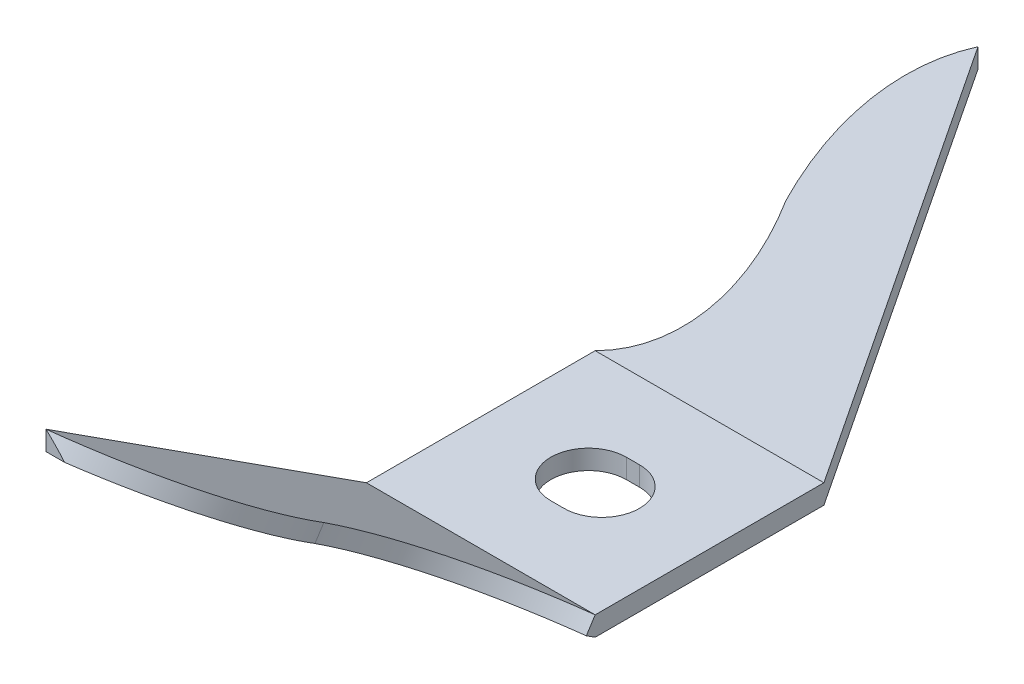
ISO-10303-21;
HEADER;
FILE_DESCRIPTION(('STEP AP214'),'2;1');
FILE_NAME('part.step','',(''),(''),'','','');
FILE_SCHEMA(('AUTOMOTIVE_DESIGN { 1 0 10303 214 1 1 1 1 }'));
ENDSEC;
DATA;
#1=APPLICATION_CONTEXT('core data for automotive mechanical design processes');
#2=APPLICATION_PROTOCOL_DEFINITION('international standard','automotive_design',2000,#1);
#3=PRODUCT_CONTEXT('',#1,'mechanical');
#4=PRODUCT('Part','Part','',(#3));
#5=PRODUCT_RELATED_PRODUCT_CATEGORY('part','',(#4));
#6=PRODUCT_DEFINITION_FORMATION('','',#4);
#7=PRODUCT_DEFINITION_CONTEXT('part definition',#1,'design');
#8=PRODUCT_DEFINITION('design','',#6,#7);
#9=PRODUCT_DEFINITION_SHAPE('','',#8);
#10=(LENGTH_UNIT() NAMED_UNIT(*) SI_UNIT(.MILLI.,.METRE.));
#11=(NAMED_UNIT(*) PLANE_ANGLE_UNIT() SI_UNIT($,.RADIAN.));
#12=(NAMED_UNIT(*) SI_UNIT($,.STERADIAN.) SOLID_ANGLE_UNIT());
#13=UNCERTAINTY_MEASURE_WITH_UNIT(LENGTH_MEASURE(1.E-05),#10,'distance_accuracy_value','');
#14=(GEOMETRIC_REPRESENTATION_CONTEXT(3) GLOBAL_UNCERTAINTY_ASSIGNED_CONTEXT((#13)) GLOBAL_UNIT_ASSIGNED_CONTEXT((#10,
#11,#12)) REPRESENTATION_CONTEXT('',''));
#15=CARTESIAN_POINT('',(0.,0.,0.));
#16=DIRECTION('',(0.,0.,1.));
#17=DIRECTION('',(1.,0.,0.));
#18=AXIS2_PLACEMENT_3D('',#15,#16,#17);
#19=CARTESIAN_POINT('',(0.,1.2954,0.));
#20=DIRECTION('',(0.,-1.,0.));
#21=DIRECTION('',(0.,0.,-1.));
#22=AXIS2_PLACEMENT_3D('',#19,#20,#21);
#23=PLANE('',#22);
#24=DIRECTION('',(0.,0.,-1.));
#25=VECTOR('',#24,1.);
#26=CARTESIAN_POINT('',(7.62,1.2954,7.62));
#27=LINE('',#26,#25);
#28=CARTESIAN_POINT('',(7.62,1.2954,7.62));
#29=VERTEX_POINT('',#28);
#30=CARTESIAN_POINT('',(7.62,1.2954,-7.62));
#31=VERTEX_POINT('',#30);
#32=EDGE_CURVE('E219',#29,#31,#27,.T.);
#33=ORIENTED_EDGE('',*,*,#32,.T.);
#34=DIRECTION('',(-1.,0.,0.));
#35=VECTOR('',#34,1.);
#36=CARTESIAN_POINT('',(-7.62,1.2954,-7.62));
#37=LINE('',#36,#35);
#38=CARTESIAN_POINT('',(-7.62,1.2954,-7.62));
#39=VERTEX_POINT('',#38);
#40=EDGE_CURVE('E165',#31,#39,#37,.T.);
#41=ORIENTED_EDGE('',*,*,#40,.T.);
#42=DIRECTION('',(0.,0.,1.));
#43=VECTOR('',#42,1.);
#44=CARTESIAN_POINT('',(-7.62,1.2954,7.62));
#45=LINE('',#44,#43);
#46=CARTESIAN_POINT('',(-7.62,1.2954,7.62));
#47=VERTEX_POINT('',#46);
#48=EDGE_CURVE('E223',#39,#47,#45,.T.);
#49=ORIENTED_EDGE('',*,*,#48,.T.);
#50=DIRECTION('',(1.,0.,0.));
#51=VECTOR('',#50,1.);
#52=CARTESIAN_POINT('',(-7.62,1.2954,7.62));
#53=LINE('',#52,#51);
#54=EDGE_CURVE('E225',#47,#29,#53,.T.);
#55=ORIENTED_EDGE('',*,*,#54,.T.);
#56=EDGE_LOOP('',(#33,#41,#49,#55));
#57=FACE_BOUND('',#56,.T.);
#58=CARTESIAN_POINT('',(-0.439419999999999,1.2954,0.));
#59=DIRECTION('',(0.,1.,0.));
#60=DIRECTION('',(0.,0.,1.));
#61=AXIS2_PLACEMENT_3D('',#58,#59,#60);
#62=CIRCLE('',#61,2.5146);
#63=CARTESIAN_POINT('',(-0.439419999999999,1.2954,-2.5146));
#64=VERTEX_POINT('',#63);
#65=CARTESIAN_POINT('',(-0.439419999999999,1.2954,2.5146));
#66=VERTEX_POINT('',#65);
#67=EDGE_CURVE('E190',#64,#66,#62,.T.);
#68=ORIENTED_EDGE('',*,*,#67,.F.);
#69=DIRECTION('',(-1.,0.,0.));
#70=VECTOR('',#69,1.);
#71=CARTESIAN_POINT('',(-0.439419999999999,1.2954,-2.5146));
#72=LINE('',#71,#70);
#73=CARTESIAN_POINT('',(0.439419999999999,1.2954,-2.5146));
#74=VERTEX_POINT('',#73);
#75=EDGE_CURVE('E197',#74,#64,#72,.T.);
#76=ORIENTED_EDGE('',*,*,#75,.F.);
#77=CARTESIAN_POINT('',(0.439419999999999,1.2954,0.));
#78=DIRECTION('',(0.,1.,0.));
#79=DIRECTION('',(0.,0.,1.));
#80=AXIS2_PLACEMENT_3D('',#77,#78,#79);
#81=CIRCLE('',#80,2.5146);
#82=CARTESIAN_POINT('',(0.439419999999999,1.2954,2.5146));
#83=VERTEX_POINT('',#82);
#84=EDGE_CURVE('E195',#83,#74,#81,.T.);
#85=ORIENTED_EDGE('',*,*,#84,.F.);
#86=DIRECTION('',(1.,0.,0.));
#87=VECTOR('',#86,1.);
#88=CARTESIAN_POINT('',(-0.439419999999999,1.2954,2.5146));
#89=LINE('',#88,#87);
#90=EDGE_CURVE('E192',#66,#83,#89,.T.);
#91=ORIENTED_EDGE('',*,*,#90,.F.);
#92=EDGE_LOOP('',(#68,#76,#85,#91));
#93=FACE_BOUND('',#92,.T.);
#94=ADVANCED_FACE('F32',(#57,#93),#23,.F.);
#95=CARTESIAN_POINT('',(0.,0.,0.));
#96=DIRECTION('',(0.,-1.,0.));
#97=DIRECTION('',(0.,0.,-1.));
#98=AXIS2_PLACEMENT_3D('',#95,#96,#97);
#99=PLANE('',#98);
#100=DIRECTION('',(0.,0.,-1.));
#101=VECTOR('',#100,1.);
#102=CARTESIAN_POINT('',(7.62,0.,7.62));
#103=LINE('',#102,#101);
#104=CARTESIAN_POINT('',(7.62,0.,7.62));
#105=VERTEX_POINT('',#104);
#106=CARTESIAN_POINT('',(7.62,0.,-7.62));
#107=VERTEX_POINT('',#106);
#108=EDGE_CURVE('E218',#105,#107,#103,.T.);
#109=ORIENTED_EDGE('',*,*,#108,.F.);
#110=DIRECTION('',(1.,0.,0.));
#111=VECTOR('',#110,1.);
#112=CARTESIAN_POINT('',(-7.62,0.,7.62));
#113=LINE('',#112,#111);
#114=CARTESIAN_POINT('',(-7.62,0.,7.62));
#115=VERTEX_POINT('',#114);
#116=EDGE_CURVE('E221',#115,#105,#113,.T.);
#117=ORIENTED_EDGE('',*,*,#116,.F.);
#118=DIRECTION('',(0.,0.,1.));
#119=VECTOR('',#118,1.);
#120=CARTESIAN_POINT('',(-7.62,0.,7.62));
#121=LINE('',#120,#119);
#122=CARTESIAN_POINT('',(-7.62,0.,-7.62));
#123=VERTEX_POINT('',#122);
#124=EDGE_CURVE('E232',#123,#115,#121,.T.);
#125=ORIENTED_EDGE('',*,*,#124,.F.);
#126=DIRECTION('',(-1.,0.,0.));
#127=VECTOR('',#126,1.);
#128=CARTESIAN_POINT('',(-7.62,0.,-7.62));
#129=LINE('',#128,#127);
#130=EDGE_CURVE('E229',#107,#123,#129,.T.);
#131=ORIENTED_EDGE('',*,*,#130,.F.);
#132=EDGE_LOOP('',(#109,#117,#125,#131));
#133=FACE_BOUND('',#132,.T.);
#134=DIRECTION('',(-1.,0.,0.));
#135=VECTOR('',#134,1.);
#136=CARTESIAN_POINT('',(-0.439419999999999,0.,-2.5146));
#137=LINE('',#136,#135);
#138=CARTESIAN_POINT('',(0.439419999999999,0.,-2.5146));
#139=VERTEX_POINT('',#138);
#140=CARTESIAN_POINT('',(-0.439419999999999,0.,-2.5146));
#141=VERTEX_POINT('',#140);
#142=EDGE_CURVE('E193',#139,#141,#137,.T.);
#143=ORIENTED_EDGE('',*,*,#142,.T.);
#144=CARTESIAN_POINT('',(-0.439419999999999,0.,0.));
#145=DIRECTION('',(0.,1.,0.));
#146=DIRECTION('',(0.,0.,1.));
#147=AXIS2_PLACEMENT_3D('',#144,#145,#146);
#148=CIRCLE('',#147,2.5146);
#149=CARTESIAN_POINT('',(-0.439419999999999,0.,2.5146));
#150=VERTEX_POINT('',#149);
#151=EDGE_CURVE('E189',#141,#150,#148,.T.);
#152=ORIENTED_EDGE('',*,*,#151,.T.);
#153=DIRECTION('',(1.,0.,0.));
#154=VECTOR('',#153,1.);
#155=CARTESIAN_POINT('',(-0.439419999999999,0.,2.5146));
#156=LINE('',#155,#154);
#157=CARTESIAN_POINT('',(0.439419999999999,0.,2.5146));
#158=VERTEX_POINT('',#157);
#159=EDGE_CURVE('E202',#150,#158,#156,.T.);
#160=ORIENTED_EDGE('',*,*,#159,.T.);
#161=CARTESIAN_POINT('',(0.439419999999999,0.,0.));
#162=DIRECTION('',(0.,1.,0.));
#163=DIRECTION('',(0.,0.,1.));
#164=AXIS2_PLACEMENT_3D('',#161,#162,#163);
#165=CIRCLE('',#164,2.5146);
#166=EDGE_CURVE('E205',#158,#139,#165,.T.);
#167=ORIENTED_EDGE('',*,*,#166,.T.);
#168=EDGE_LOOP('',(#143,#152,#160,#167));
#169=FACE_BOUND('',#168,.T.);
#170=ADVANCED_FACE('F249',(#133,#169),#99,.T.);
#171=CARTESIAN_POINT('',(7.62,1.2954,7.62));
#172=DIRECTION('',(-1.,0.,0.));
#173=DIRECTION('',(0.,0.,1.));
#174=AXIS2_PLACEMENT_3D('',#171,#172,#173);
#175=PLANE('',#174);
#176=ORIENTED_EDGE('',*,*,#32,.F.);
#177=DIRECTION('',(0.,0.840447978447659,-0.541892236079503));
#178=VECTOR('',#177,1.);
#179=CARTESIAN_POINT('',(7.62,-11.5130271915423,15.8784376778516));
#180=LINE('',#179,#178);
#181=CARTESIAN_POINT('',(7.62,0.380390577080808,8.20996691637634));
#182=VERTEX_POINT('',#181);
#183=EDGE_CURVE('E239',#182,#29,#180,.T.);
#184=ORIENTED_EDGE('',*,*,#183,.F.);
#185=DIRECTION('',(0.,0.541892236079503,0.840447978447659));
#186=VECTOR('',#185,1.);
#187=CARTESIAN_POINT('',(7.62,0.,7.62));
#188=LINE('',#187,#186);
#189=EDGE_CURVE('E176',#105,#182,#188,.T.);
#190=ORIENTED_EDGE('',*,*,#189,.F.);
#191=ORIENTED_EDGE('',*,*,#108,.T.);
#192=DIRECTION('',(0.,-0.889889738240533,0.456175683014994));
#193=VECTOR('',#192,1.);
#194=CARTESIAN_POINT('',(7.62,0.,-7.62));
#195=LINE('',#194,#193);
#196=CARTESIAN_POINT('',(7.62,20.0256911094954,-17.8855788994525));
#197=VERTEX_POINT('',#196);
#198=EDGE_CURVE('E160',#197,#107,#195,.T.);
#199=ORIENTED_EDGE('',*,*,#198,.F.);
#200=DIRECTION('',(0.,-1.,0.));
#201=VECTOR('',#200,1.);
#202=CARTESIAN_POINT('',(7.62,21.3210911094954,-17.8855788994525));
#203=LINE('',#202,#201);
#204=CARTESIAN_POINT('',(7.62,21.3210911094954,-17.8855788994525));
#205=VERTEX_POINT('',#204);
#206=EDGE_CURVE('E149',#205,#197,#203,.T.);
#207=ORIENTED_EDGE('',*,*,#206,.F.);
#208=DIRECTION('',(0.,0.889889738240533,-0.456175683014994));
#209=VECTOR('',#208,1.);
#210=CARTESIAN_POINT('',(7.62,1.2954,-7.62));
#211=LINE('',#210,#209);
#212=EDGE_CURVE('E158',#31,#205,#211,.T.);
#213=ORIENTED_EDGE('',*,*,#212,.F.);
#214=EDGE_LOOP('',(#176,#184,#190,#191,#199,#207,#213));
#215=FACE_BOUND('',#214,.T.);
#216=ADVANCED_FACE('F34',(#215),#175,.F.);
#217=CARTESIAN_POINT('',(-7.62,1.2954,7.62));
#218=DIRECTION('',(1.,0.,0.));
#219=DIRECTION('',(0.,0.,-1.));
#220=AXIS2_PLACEMENT_3D('',#217,#218,#219);
#221=PLANE('',#220);
#222=ORIENTED_EDGE('',*,*,#48,.F.);
#223=DIRECTION('',(0.,0.456175683014994,0.889889738240533));
#224=VECTOR('',#223,1.);
#225=CARTESIAN_POINT('',(-7.62,-5.65671740914851,-21.1819196107857));
#226=LINE('',#225,#224);
#227=CARTESIAN_POINT('',(-7.62,1.02583211286091,-8.14586252502279));
#228=VERTEX_POINT('',#227);
#229=EDGE_CURVE('E257',#228,#39,#226,.T.);
#230=ORIENTED_EDGE('',*,*,#229,.F.);
#231=DIRECTION('',(0.,-0.889889738240533,0.456175683014994));
#232=VECTOR('',#231,1.);
#233=CARTESIAN_POINT('',(-7.62,0.,-7.62));
#234=LINE('',#233,#232);
#235=EDGE_CURVE('E166',#228,#123,#234,.T.);
#236=ORIENTED_EDGE('',*,*,#235,.T.);
#237=ORIENTED_EDGE('',*,*,#124,.T.);
#238=DIRECTION('',(0.,0.541892236079503,0.840447978447659));
#239=VECTOR('',#238,1.);
#240=CARTESIAN_POINT('',(-7.62,0.,7.62));
#241=LINE('',#240,#239);
#242=CARTESIAN_POINT('',(-7.62,13.7640627964194,28.9673786525705));
#243=VERTEX_POINT('',#242);
#244=EDGE_CURVE('E175',#115,#243,#241,.T.);
#245=ORIENTED_EDGE('',*,*,#244,.T.);
#246=DIRECTION('',(0.,1.,0.));
#247=VECTOR('',#246,1.);
#248=CARTESIAN_POINT('',(-7.62,15.0594627964194,28.9673786525705));
#249=LINE('',#248,#247);
#250=CARTESIAN_POINT('',(-7.62,15.0594627964194,28.9673786525705));
#251=VERTEX_POINT('',#250);
#252=EDGE_CURVE('E183',#243,#251,#249,.T.);
#253=ORIENTED_EDGE('',*,*,#252,.T.);
#254=DIRECTION('',(0.,-0.541892236079503,-0.840447978447659));
#255=VECTOR('',#254,1.);
#256=CARTESIAN_POINT('',(-7.62,1.2954,7.62));
#257=LINE('',#256,#255);
#258=EDGE_CURVE('E180',#251,#47,#257,.T.);
#259=ORIENTED_EDGE('',*,*,#258,.T.);
#260=EDGE_LOOP('',(#222,#230,#236,#237,#245,#253,#259));
#261=FACE_BOUND('',#260,.T.);
#262=ADVANCED_FACE('F254',(#261),#221,.F.);
#263=CARTESIAN_POINT('',(-0.439419999999999,1.2954,0.));
#264=DIRECTION('',(0.,-1.,0.));
#265=DIRECTION('',(0.,0.,-1.));
#266=AXIS2_PLACEMENT_3D('',#263,#264,#265);
#267=CYLINDRICAL_SURFACE('',#266,2.5146);
#268=ORIENTED_EDGE('',*,*,#151,.F.);
#269=DIRECTION('',(0.,-1.,0.));
#270=VECTOR('',#269,1.);
#271=CARTESIAN_POINT('',(-0.439419999999999,1.2954,-2.5146));
#272=LINE('',#271,#270);
#273=EDGE_CURVE('E199',#64,#141,#272,.T.);
#274=ORIENTED_EDGE('',*,*,#273,.F.);
#275=ORIENTED_EDGE('',*,*,#67,.T.);
#276=DIRECTION('',(0.,-1.,0.));
#277=VECTOR('',#276,1.);
#278=CARTESIAN_POINT('',(-0.439419999999999,1.2954,2.5146));
#279=LINE('',#278,#277);
#280=EDGE_CURVE('E215',#66,#150,#279,.T.);
#281=ORIENTED_EDGE('',*,*,#280,.T.);
#282=EDGE_LOOP('',(#268,#274,#275,#281));
#283=FACE_BOUND('',#282,.T.);
#284=ADVANCED_FACE('F290',(#283),#267,.F.);
#285=CARTESIAN_POINT('',(-0.439419999999999,1.2954,2.5146));
#286=DIRECTION('',(0.,0.,-1.));
#287=DIRECTION('',(-1.,0.,0.));
#288=AXIS2_PLACEMENT_3D('',#285,#286,#287);
#289=PLANE('',#288);
#290=ORIENTED_EDGE('',*,*,#159,.F.);
#291=ORIENTED_EDGE('',*,*,#280,.F.);
#292=ORIENTED_EDGE('',*,*,#90,.T.);
#293=DIRECTION('',(0.,-1.,0.));
#294=VECTOR('',#293,1.);
#295=CARTESIAN_POINT('',(0.439419999999999,1.2954,2.5146));
#296=LINE('',#295,#294);
#297=EDGE_CURVE('E213',#83,#158,#296,.T.);
#298=ORIENTED_EDGE('',*,*,#297,.T.);
#299=EDGE_LOOP('',(#290,#291,#292,#298));
#300=FACE_BOUND('',#299,.T.);
#301=ADVANCED_FACE('F292',(#300),#289,.T.);
#302=CARTESIAN_POINT('',(0.439419999999999,1.2954,0.));
#303=DIRECTION('',(0.,-1.,0.));
#304=DIRECTION('',(0.,0.,-1.));
#305=AXIS2_PLACEMENT_3D('',#302,#303,#304);
#306=CYLINDRICAL_SURFACE('',#305,2.5146);
#307=ORIENTED_EDGE('',*,*,#166,.F.);
#308=ORIENTED_EDGE('',*,*,#297,.F.);
#309=ORIENTED_EDGE('',*,*,#84,.T.);
#310=DIRECTION('',(0.,-1.,0.));
#311=VECTOR('',#310,1.);
#312=CARTESIAN_POINT('',(0.439419999999999,1.2954,-2.5146));
#313=LINE('',#312,#311);
#314=EDGE_CURVE('E54',#74,#139,#313,.T.);
#315=ORIENTED_EDGE('',*,*,#314,.T.);
#316=EDGE_LOOP('',(#307,#308,#309,#315));
#317=FACE_BOUND('',#316,.T.);
#318=ADVANCED_FACE('F297',(#317),#306,.F.);
#319=CARTESIAN_POINT('',(-0.439419999999999,1.2954,-2.5146));
#320=DIRECTION('',(0.,0.,1.));
#321=DIRECTION('',(1.,0.,0.));
#322=AXIS2_PLACEMENT_3D('',#319,#320,#321);
#323=PLANE('',#322);
#324=ORIENTED_EDGE('',*,*,#142,.F.);
#325=ORIENTED_EDGE('',*,*,#314,.F.);
#326=ORIENTED_EDGE('',*,*,#75,.T.);
#327=ORIENTED_EDGE('',*,*,#273,.T.);
#328=EDGE_LOOP('',(#324,#325,#326,#327));
#329=FACE_BOUND('',#328,.T.);
#330=ADVANCED_FACE('F295',(#329),#323,.T.);
#331=CARTESIAN_POINT('',(7.62,1.2954,7.62));
#332=DIRECTION('',(0.,0.840447978447659,-0.541892236079503));
#333=DIRECTION('',(0.,0.541892236079503,0.840447978447659));
#334=AXIS2_PLACEMENT_3D('',#331,#332,#333);
#335=PLANE('',#334);
#336=CARTESIAN_POINT('',(-13.8085582962301,8.36238976551006,18.5805505793994));
#337=DIRECTION('',(0.,-0.840447978447659,0.541892236079503));
#338=DIRECTION('',(0.,0.541892236079503,0.840447978447659));
#339=AXIS2_PLACEMENT_3D('',#336,#337,#338);
#340=CIRCLE('',#339,13.8215497824516);
#341=CARTESIAN_POINT('',(0.,8.03772613624584,18.077013394839));
#342=VERTEX_POINT('',#341);
#343=EDGE_CURVE('E261',#342,#251,#340,.T.);
#344=ORIENTED_EDGE('',*,*,#343,.F.);
#345=CARTESIAN_POINT('',(14.4033711536586,8.18221006394035,18.3011007997953));
#346=DIRECTION('',(0.,0.840447978447659,-0.541892236079503));
#347=DIRECTION('',(0.,-0.541892236079503,-0.840447978447659));
#348=AXIS2_PLACEMENT_3D('',#345,#346,#347);
#349=CIRCLE('',#348,14.4058387940608);
#350=EDGE_CURVE('E244',#29,#342,#349,.T.);
#351=ORIENTED_EDGE('',*,*,#350,.F.);
#352=ORIENTED_EDGE('',*,*,#54,.F.);
#353=ORIENTED_EDGE('',*,*,#258,.F.);
#354=EDGE_LOOP('',(#344,#351,#352,#353));
#355=FACE_BOUND('',#354,.T.);
#356=ADVANCED_FACE('F278',(#355),#335,.T.);
#357=CARTESIAN_POINT('',(7.62,15.0594627964194,28.9673786525705));
#358=DIRECTION('',(0.,0.,1.));
#359=DIRECTION('',(1.,0.,0.));
#360=AXIS2_PLACEMENT_3D('',#357,#358,#359);
#361=PLANE('',#360);
#362=CARTESIAN_POINT('',(-13.8085582962301,-7.74706535371652,28.9673786525705));
#363=DIRECTION('',(0.,0.,1.));
#364=DIRECTION('',(0.,1.,0.));
#365=AXIS2_PLACEMENT_3D('',#362,#363,#364);
#366=ELLIPSE('',#365,25.5060856425036,13.8215497824516);
#367=CARTESIAN_POINT('',(-6.38183138319716,13.7640627964194,28.9673786525705));
#368=VERTEX_POINT('',#367);
#369=EDGE_CURVE('E168',#251,#368,#366,.F.);
#370=ORIENTED_EDGE('',*,*,#369,.F.);
#371=ORIENTED_EDGE('',*,*,#252,.F.);
#372=DIRECTION('',(-1.,0.,0.));
#373=VECTOR('',#372,1.);
#374=CARTESIAN_POINT('',(7.62,13.7640627964194,28.9673786525705));
#375=LINE('',#374,#373);
#376=EDGE_CURVE('E179',#368,#243,#375,.T.);
#377=ORIENTED_EDGE('',*,*,#376,.F.);
#378=EDGE_LOOP('',(#370,#371,#377));
#379=FACE_BOUND('',#378,.T.);
#380=ADVANCED_FACE('F274',(#379),#361,.T.);
#381=CARTESIAN_POINT('',(7.62,0.,7.62));
#382=DIRECTION('',(0.,-0.840447978447659,0.541892236079503));
#383=DIRECTION('',(0.,-0.541892236079503,-0.840447978447659));
#384=AXIS2_PLACEMENT_3D('',#381,#382,#383);
#385=PLANE('',#384);
#386=CARTESIAN_POINT('',(-13.8085582962301,7.44738034259087,19.1705174957757));
#387=DIRECTION('',(0.,-0.840447978447659,0.541892236079503));
#388=DIRECTION('',(0.,-0.541892236079503,-0.840447978447659));
#389=AXIS2_PLACEMENT_3D('',#386,#387,#388);
#390=CIRCLE('',#389,13.8215497824516);
#391=CARTESIAN_POINT('',(0.,7.12271671332664,18.6669803112154));
#392=VERTEX_POINT('',#391);
#393=EDGE_CURVE('E11',#368,#392,#390,.F.);
#394=ORIENTED_EDGE('',*,*,#393,.F.);
#395=ORIENTED_EDGE('',*,*,#376,.T.);
#396=ORIENTED_EDGE('',*,*,#244,.F.);
#397=ORIENTED_EDGE('',*,*,#116,.T.);
#398=ORIENTED_EDGE('',*,*,#189,.T.);
#399=CARTESIAN_POINT('',(14.4033711536586,7.26720064102115,18.8910677161717));
#400=DIRECTION('',(0.,-0.840447978447659,0.541892236079503));
#401=DIRECTION('',(0.,-0.541892236079503,-0.840447978447659));
#402=AXIS2_PLACEMENT_3D('',#399,#400,#401);
#403=CIRCLE('',#402,14.4058387940608);
#404=EDGE_CURVE('E40',#392,#182,#403,.T.);
#405=ORIENTED_EDGE('',*,*,#404,.F.);
#406=EDGE_LOOP('',(#394,#395,#396,#397,#398,#405));
#407=FACE_BOUND('',#406,.T.);
#408=ADVANCED_FACE('F245',(#407),#385,.T.);
#409=CARTESIAN_POINT('',(7.62,0.,-7.62));
#410=DIRECTION('',(0.,-0.456175683014994,-0.889889738240533));
#411=DIRECTION('',(0.,0.889889738240533,-0.456175683014994));
#412=AXIS2_PLACEMENT_3D('',#409,#410,#411);
#413=PLANE('',#412);
#414=CARTESIAN_POINT('',(17.47831148793,7.83111841919024,-11.6343914915893));
#415=DIRECTION('',(0.,-0.456175683014994,-0.889889738240533));
#416=DIRECTION('',(0.,0.889889738240533,-0.456175683014994));
#417=AXIS2_PLACEMENT_3D('',#414,#415,#416);
#418=CIRCLE('',#417,17.8295769536312);
#419=CARTESIAN_POINT('',(6.07178409182494,20.0256911094954,-17.8855788994525));
#420=VERTEX_POINT('',#419);
#421=CARTESIAN_POINT('',(0.,10.9650520790228,-13.2409099919874));
#422=VERTEX_POINT('',#421);
#423=EDGE_CURVE('E152',#420,#422,#418,.F.);
#424=ORIENTED_EDGE('',*,*,#423,.F.);
#425=DIRECTION('',(-1.,0.,0.));
#426=VECTOR('',#425,1.);
#427=CARTESIAN_POINT('',(7.62,20.0256911094954,-17.8855788994525));
#428=LINE('',#427,#426);
#429=EDGE_CURVE('E151',#197,#420,#428,.T.);
#430=ORIENTED_EDGE('',*,*,#429,.F.);
#431=ORIENTED_EDGE('',*,*,#198,.T.);
#432=ORIENTED_EDGE('',*,*,#130,.T.);
#433=ORIENTED_EDGE('',*,*,#235,.F.);
#434=CARTESIAN_POINT('',(-12.8524782232164,11.4853181347417,-13.5076090144823));
#435=DIRECTION('',(0.,-0.456175683014994,-0.889889738240533));
#436=DIRECTION('',(0.,0.889889738240533,-0.456175683014994));
#437=AXIS2_PLACEMENT_3D('',#434,#435,#436);
#438=CIRCLE('',#437,12.865768597934);
#439=EDGE_CURVE('E153',#422,#228,#438,.T.);
#440=ORIENTED_EDGE('',*,*,#439,.F.);
#441=EDGE_LOOP('',(#424,#430,#431,#432,#433,#440));
#442=FACE_BOUND('',#441,.T.);
#443=ADVANCED_FACE('F260',(#442),#413,.T.);
#444=CARTESIAN_POINT('',(7.62,21.3210911094954,-17.8855788994525));
#445=DIRECTION('',(0.,0.,-1.));
#446=DIRECTION('',(-1.,0.,0.));
#447=AXIS2_PLACEMENT_3D('',#444,#445,#446);
#448=PLANE('',#447);
#449=CARTESIAN_POINT('',(17.47831148793,4.62663188238071,-17.8855788994525));
#450=DIRECTION('',(0.,0.,-1.));
#451=DIRECTION('',(0.,1.,0.));
#452=AXIS2_PLACEMENT_3D('',#449,#450,#451);
#453=ELLIPSE('',#452,20.0357147492041,17.8295769536312);
#454=EDGE_CURVE('E134',#205,#420,#453,.F.);
#455=ORIENTED_EDGE('',*,*,#454,.F.);
#456=ORIENTED_EDGE('',*,*,#206,.T.);
#457=ORIENTED_EDGE('',*,*,#429,.T.);
#458=EDGE_LOOP('',(#455,#456,#457));
#459=FACE_BOUND('',#458,.T.);
#460=ADVANCED_FACE('F148',(#459),#448,.T.);
#461=CARTESIAN_POINT('',(7.62,1.2954,-7.62));
#462=DIRECTION('',(0.,0.456175683014994,0.889889738240533));
#463=DIRECTION('',(0.,-0.889889738240533,0.456175683014994));
#464=AXIS2_PLACEMENT_3D('',#461,#462,#463);
#465=PLANE('',#464);
#466=CARTESIAN_POINT('',(17.47831148793,8.10068630632934,-11.1085289665665));
#467=DIRECTION('',(0.,-0.456175683014994,-0.889889738240533));
#468=DIRECTION('',(0.,-0.889889738240533,0.456175683014994));
#469=AXIS2_PLACEMENT_3D('',#466,#467,#468);
#470=CIRCLE('',#469,17.8295769536312);
#471=CARTESIAN_POINT('',(0.,11.2346199661619,-12.7150474669646));
#472=VERTEX_POINT('',#471);
#473=EDGE_CURVE('E131',#472,#205,#470,.T.);
#474=ORIENTED_EDGE('',*,*,#473,.F.);
#475=CARTESIAN_POINT('',(-12.8524782232164,11.7548860218808,-12.9817464894595));
#476=DIRECTION('',(0.,0.456175683014994,0.889889738240533));
#477=DIRECTION('',(0.,0.889889738240533,-0.456175683014994));
#478=AXIS2_PLACEMENT_3D('',#475,#476,#477);
#479=CIRCLE('',#478,12.865768597934);
#480=EDGE_CURVE('E142',#39,#472,#479,.T.);
#481=ORIENTED_EDGE('',*,*,#480,.F.);
#482=ORIENTED_EDGE('',*,*,#40,.F.);
#483=ORIENTED_EDGE('',*,*,#212,.T.);
#484=EDGE_LOOP('',(#474,#481,#482,#483));
#485=FACE_BOUND('',#484,.T.);
#486=ADVANCED_FACE('F163',(#485),#465,.T.);
#487=CARTESIAN_POINT('',(-13.8085582962301,-4.44603742603226,26.838988257251));
#488=DIRECTION('',(0.,0.840447978447659,-0.541892236079503));
#489=DIRECTION('',(0.,0.541892236079503,0.840447978447659));
#490=AXIS2_PLACEMENT_3D('',#487,#488,#489);
#491=CYLINDRICAL_SURFACE('',#490,13.8215497824516);
#492=ORIENTED_EDGE('',*,*,#369,.T.);
#493=ORIENTED_EDGE('',*,*,#393,.T.);
#494=DIRECTION('',(0.,0.840447978447659,-0.541892236079503));
#495=VECTOR('',#494,1.);
#496=CARTESIAN_POINT('',(0.,-4.77070105529648,26.3354510726906));
#497=LINE('',#496,#495);
#498=EDGE_CURVE('E47',#392,#342,#497,.T.);
#499=ORIENTED_EDGE('',*,*,#498,.T.);
#500=ORIENTED_EDGE('',*,*,#343,.T.);
#501=EDGE_LOOP('',(#492,#493,#499,#500));
#502=FACE_BOUND('',#501,.T.);
#503=ADVANCED_FACE('F269',(#502),#491,.T.);
#504=CARTESIAN_POINT('',(14.4033711536586,-4.62621712760197,26.5595384776469));
#505=DIRECTION('',(0.,0.840447978447659,-0.541892236079503));
#506=DIRECTION('',(0.,0.541892236079503,0.840447978447659));
#507=AXIS2_PLACEMENT_3D('',#504,#505,#506);
#508=CYLINDRICAL_SURFACE('',#507,14.4058387940608);
#509=ORIENTED_EDGE('',*,*,#404,.T.);
#510=ORIENTED_EDGE('',*,*,#183,.T.);
#511=ORIENTED_EDGE('',*,*,#350,.T.);
#512=ORIENTED_EDGE('',*,*,#498,.F.);
#513=EDGE_LOOP('',(#509,#510,#511,#512));
#514=FACE_BOUND('',#513,.T.);
#515=ADVANCED_FACE('F238',(#514),#508,.F.);
#516=CARTESIAN_POINT('',(17.47831148793,1.14856889718083,-24.6704485773522));
#517=DIRECTION('',(0.,0.456175683014994,0.889889738240533));
#518=DIRECTION('',(0.,-0.889889738240533,0.456175683014994));
#519=AXIS2_PLACEMENT_3D('',#516,#517,#518);
#520=CYLINDRICAL_SURFACE('',#519,17.8295769536312);
#521=ORIENTED_EDGE('',*,*,#423,.T.);
#522=DIRECTION('',(0.,0.456175683014994,0.889889738240533));
#523=VECTOR('',#522,1.);
#524=CARTESIAN_POINT('',(0.,4.28250255701342,-26.2769670777503));
#525=LINE('',#524,#523);
#526=EDGE_CURVE('E137',#422,#472,#525,.T.);
#527=ORIENTED_EDGE('',*,*,#526,.T.);
#528=ORIENTED_EDGE('',*,*,#473,.T.);
#529=ORIENTED_EDGE('',*,*,#454,.T.);
#530=EDGE_LOOP('',(#521,#527,#528,#529));
#531=FACE_BOUND('',#530,.T.);
#532=ADVANCED_FACE('F133',(#531),#520,.T.);
#533=CARTESIAN_POINT('',(-12.8524782232164,4.80276861273228,-26.5436661002453));
#534=DIRECTION('',(0.,0.456175683014994,0.889889738240533));
#535=DIRECTION('',(0.,-0.889889738240533,0.456175683014994));
#536=AXIS2_PLACEMENT_3D('',#533,#534,#535);
#537=CYLINDRICAL_SURFACE('',#536,12.865768597934);
#538=ORIENTED_EDGE('',*,*,#439,.T.);
#539=ORIENTED_EDGE('',*,*,#229,.T.);
#540=ORIENTED_EDGE('',*,*,#480,.T.);
#541=ORIENTED_EDGE('',*,*,#526,.F.);
#542=EDGE_LOOP('',(#538,#539,#540,#541));
#543=FACE_BOUND('',#542,.T.);
#544=ADVANCED_FACE('F405',(#543),#537,.F.);
#545=CLOSED_SHELL('',(#94,#170,#216,#262,#284,#301,#318,#330,#356,#380,#408,#443,#460,#486,#503,
#515,#532,#544));
#546=MANIFOLD_SOLID_BREP('B2',#545);
#547=ADVANCED_BREP_SHAPE_REPRESENTATION('',(#18,#546),#14);
#548=SHAPE_DEFINITION_REPRESENTATION(#9,#547);
ENDSEC;
END-ISO-10303-21;
